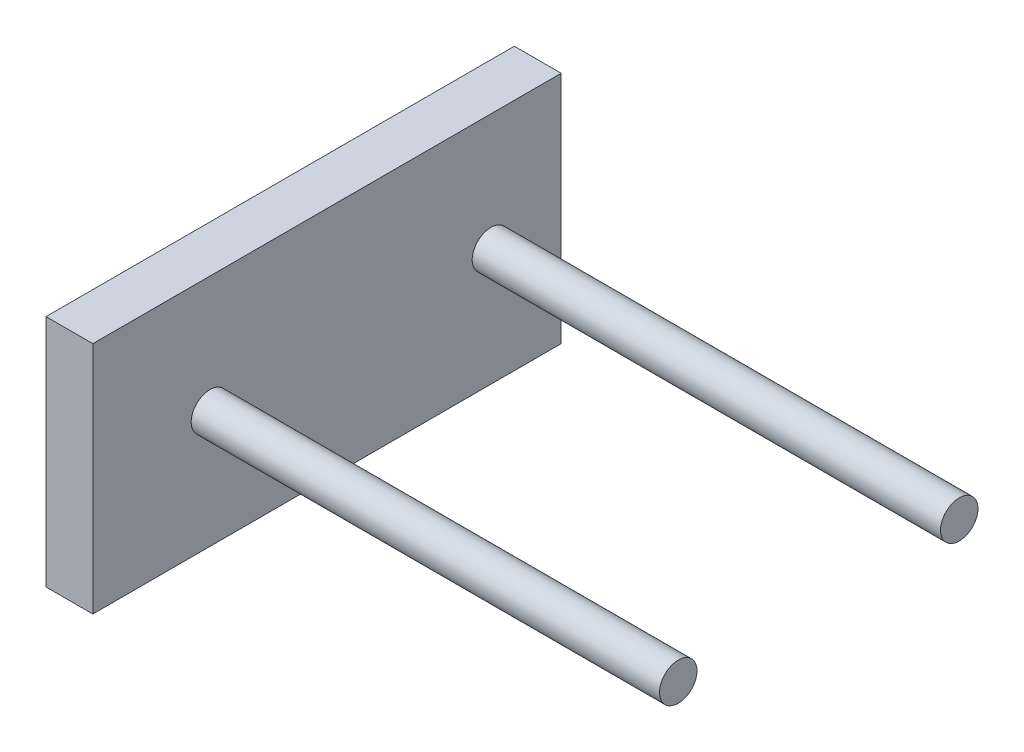
ISO-10303-21;
HEADER;
FILE_DESCRIPTION(('STEP AP214'),'2;1');
FILE_NAME('part.step','',(''),(''),'','','');
FILE_SCHEMA(('AUTOMOTIVE_DESIGN { 1 0 10303 214 1 1 1 1 }'));
ENDSEC;
DATA;
#1=APPLICATION_CONTEXT('core data for automotive mechanical design processes');
#2=APPLICATION_PROTOCOL_DEFINITION('international standard','automotive_design',2000,#1);
#3=PRODUCT_CONTEXT('',#1,'mechanical');
#4=PRODUCT('Part','Part','',(#3));
#5=PRODUCT_RELATED_PRODUCT_CATEGORY('part','',(#4));
#6=PRODUCT_DEFINITION_FORMATION('','',#4);
#7=PRODUCT_DEFINITION_CONTEXT('part definition',#1,'design');
#8=PRODUCT_DEFINITION('design','',#6,#7);
#9=PRODUCT_DEFINITION_SHAPE('','',#8);
#10=(LENGTH_UNIT() NAMED_UNIT(*) SI_UNIT(.MILLI.,.METRE.));
#11=(NAMED_UNIT(*) PLANE_ANGLE_UNIT() SI_UNIT($,.RADIAN.));
#12=(NAMED_UNIT(*) SI_UNIT($,.STERADIAN.) SOLID_ANGLE_UNIT());
#13=UNCERTAINTY_MEASURE_WITH_UNIT(LENGTH_MEASURE(1.E-05),#10,'distance_accuracy_value','');
#14=(GEOMETRIC_REPRESENTATION_CONTEXT(3) GLOBAL_UNCERTAINTY_ASSIGNED_CONTEXT((#13)) GLOBAL_UNIT_ASSIGNED_CONTEXT((#10,
#11,#12)) REPRESENTATION_CONTEXT('',''));
#15=CARTESIAN_POINT('',(0.,0.,0.));
#16=DIRECTION('',(0.,0.,1.));
#17=DIRECTION('',(1.,0.,0.));
#18=AXIS2_PLACEMENT_3D('',#15,#16,#17);
#19=CARTESIAN_POINT('',(0.,0.,0.));
#20=DIRECTION('',(1.,0.,0.));
#21=DIRECTION('',(0.,0.,-1.));
#22=AXIS2_PLACEMENT_3D('',#19,#20,#21);
#23=PLANE('',#22);
#24=DIRECTION('',(0.,1.,0.));
#25=VECTOR('',#24,1.);
#26=CARTESIAN_POINT('',(0.,-25.,-50.));
#27=LINE('',#26,#25);
#28=CARTESIAN_POINT('',(0.,-25.,-50.));
#29=VERTEX_POINT('',#28);
#30=CARTESIAN_POINT('',(0.,25.,-50.));
#31=VERTEX_POINT('',#30);
#32=EDGE_CURVE('E105',#29,#31,#27,.T.);
#33=ORIENTED_EDGE('',*,*,#32,.F.);
#34=DIRECTION('',(0.,0.,1.));
#35=VECTOR('',#34,1.);
#36=CARTESIAN_POINT('',(0.,-25.,-50.));
#37=LINE('',#36,#35);
#38=CARTESIAN_POINT('',(0.,-25.,50.));
#39=VERTEX_POINT('',#38);
#40=EDGE_CURVE('E111',#29,#39,#37,.T.);
#41=ORIENTED_EDGE('',*,*,#40,.T.);
#42=DIRECTION('',(0.,1.,0.));
#43=VECTOR('',#42,1.);
#44=CARTESIAN_POINT('',(0.,-25.,50.));
#45=LINE('',#44,#43);
#46=CARTESIAN_POINT('',(0.,25.,50.));
#47=VERTEX_POINT('',#46);
#48=EDGE_CURVE('E109',#39,#47,#45,.T.);
#49=ORIENTED_EDGE('',*,*,#48,.T.);
#50=DIRECTION('',(0.,0.,1.));
#51=VECTOR('',#50,1.);
#52=CARTESIAN_POINT('',(0.,25.,-50.));
#53=LINE('',#52,#51);
#54=EDGE_CURVE('E95',#31,#47,#53,.T.);
#55=ORIENTED_EDGE('',*,*,#54,.F.);
#56=EDGE_LOOP('',(#33,#41,#49,#55));
#57=FACE_BOUND('',#56,.T.);
#58=CARTESIAN_POINT('',(0.,5.00000000000001,-35.));
#59=DIRECTION('',(1.,0.,0.));
#60=DIRECTION('',(0.,0.,-1.));
#61=AXIS2_PLACEMENT_3D('',#58,#59,#60);
#62=CIRCLE('',#61,7.5);
#63=CARTESIAN_POINT('',(0.,5.00000000000001,-42.5));
#64=VERTEX_POINT('',#63);
#65=EDGE_CURVE('E11',#64,#64,#62,.F.);
#66=ORIENTED_EDGE('',*,*,#65,.F.);
#67=EDGE_LOOP('',(#66));
#68=FACE_BOUND('',#67,.T.);
#69=ADVANCED_FACE('F37',(#57,#68),#23,.F.);
#70=CARTESIAN_POINT('',(10.,-25.,-50.));
#71=DIRECTION('',(0.,0.,1.));
#72=DIRECTION('',(1.,0.,0.));
#73=AXIS2_PLACEMENT_3D('',#70,#71,#72);
#74=PLANE('',#73);
#75=ORIENTED_EDGE('',*,*,#32,.T.);
#76=DIRECTION('',(-1.,0.,0.));
#77=VECTOR('',#76,1.);
#78=CARTESIAN_POINT('',(10.,25.,-50.));
#79=LINE('',#78,#77);
#80=CARTESIAN_POINT('',(10.,25.,-50.));
#81=VERTEX_POINT('',#80);
#82=EDGE_CURVE('E47',#81,#31,#79,.T.);
#83=ORIENTED_EDGE('',*,*,#82,.F.);
#84=DIRECTION('',(0.,1.,0.));
#85=VECTOR('',#84,1.);
#86=CARTESIAN_POINT('',(10.,-25.,-50.));
#87=LINE('',#86,#85);
#88=CARTESIAN_POINT('',(10.,-25.,-50.));
#89=VERTEX_POINT('',#88);
#90=EDGE_CURVE('E89',#89,#81,#87,.T.);
#91=ORIENTED_EDGE('',*,*,#90,.F.);
#92=DIRECTION('',(-1.,0.,0.));
#93=VECTOR('',#92,1.);
#94=CARTESIAN_POINT('',(10.,-25.,-50.));
#95=LINE('',#94,#93);
#96=EDGE_CURVE('E55',#89,#29,#95,.T.);
#97=ORIENTED_EDGE('',*,*,#96,.T.);
#98=EDGE_LOOP('',(#75,#83,#91,#97));
#99=FACE_BOUND('',#98,.T.);
#100=ADVANCED_FACE('F39',(#99),#74,.F.);
#101=CARTESIAN_POINT('',(10.,25.,-50.));
#102=DIRECTION('',(0.,-1.,0.));
#103=DIRECTION('',(0.,0.,-1.));
#104=AXIS2_PLACEMENT_3D('',#101,#102,#103);
#105=PLANE('',#104);
#106=ORIENTED_EDGE('',*,*,#54,.T.);
#107=DIRECTION('',(-1.,0.,0.));
#108=VECTOR('',#107,1.);
#109=CARTESIAN_POINT('',(10.,25.,50.));
#110=LINE('',#109,#108);
#111=CARTESIAN_POINT('',(10.,25.,50.));
#112=VERTEX_POINT('',#111);
#113=EDGE_CURVE('E93',#112,#47,#110,.T.);
#114=ORIENTED_EDGE('',*,*,#113,.F.);
#115=DIRECTION('',(0.,0.,1.));
#116=VECTOR('',#115,1.);
#117=CARTESIAN_POINT('',(10.,25.,-50.));
#118=LINE('',#117,#116);
#119=EDGE_CURVE('E81',#81,#112,#118,.T.);
#120=ORIENTED_EDGE('',*,*,#119,.F.);
#121=ORIENTED_EDGE('',*,*,#82,.T.);
#122=EDGE_LOOP('',(#106,#114,#120,#121));
#123=FACE_BOUND('',#122,.T.);
#124=ADVANCED_FACE('F94',(#123),#105,.F.);
#125=CARTESIAN_POINT('',(10.,-25.,50.));
#126=DIRECTION('',(0.,0.,1.));
#127=DIRECTION('',(1.,0.,0.));
#128=AXIS2_PLACEMENT_3D('',#125,#126,#127);
#129=PLANE('',#128);
#130=ORIENTED_EDGE('',*,*,#48,.F.);
#131=DIRECTION('',(-1.,0.,0.));
#132=VECTOR('',#131,1.);
#133=CARTESIAN_POINT('',(10.,-25.,50.));
#134=LINE('',#133,#132);
#135=CARTESIAN_POINT('',(10.,-25.,50.));
#136=VERTEX_POINT('',#135);
#137=EDGE_CURVE('E69',#136,#39,#134,.T.);
#138=ORIENTED_EDGE('',*,*,#137,.F.);
#139=DIRECTION('',(0.,1.,0.));
#140=VECTOR('',#139,1.);
#141=CARTESIAN_POINT('',(10.,-25.,50.));
#142=LINE('',#141,#140);
#143=EDGE_CURVE('E88',#136,#112,#142,.T.);
#144=ORIENTED_EDGE('',*,*,#143,.T.);
#145=ORIENTED_EDGE('',*,*,#113,.T.);
#146=EDGE_LOOP('',(#130,#138,#144,#145));
#147=FACE_BOUND('',#146,.T.);
#148=ADVANCED_FACE('F99',(#147),#129,.T.);
#149=CARTESIAN_POINT('',(10.,-25.,-50.));
#150=DIRECTION('',(0.,-1.,0.));
#151=DIRECTION('',(0.,0.,-1.));
#152=AXIS2_PLACEMENT_3D('',#149,#150,#151);
#153=PLANE('',#152);
#154=ORIENTED_EDGE('',*,*,#40,.F.);
#155=ORIENTED_EDGE('',*,*,#96,.F.);
#156=DIRECTION('',(0.,0.,1.));
#157=VECTOR('',#156,1.);
#158=CARTESIAN_POINT('',(10.,-25.,-50.));
#159=LINE('',#158,#157);
#160=EDGE_CURVE('E100',#89,#136,#159,.T.);
#161=ORIENTED_EDGE('',*,*,#160,.T.);
#162=ORIENTED_EDGE('',*,*,#137,.T.);
#163=EDGE_LOOP('',(#154,#155,#161,#162));
#164=FACE_BOUND('',#163,.T.);
#165=ADVANCED_FACE('F117',(#164),#153,.T.);
#166=CARTESIAN_POINT('',(10.,0.,0.));
#167=DIRECTION('',(1.,0.,0.));
#168=DIRECTION('',(0.,0.,-1.));
#169=AXIS2_PLACEMENT_3D('',#166,#167,#168);
#170=PLANE('',#169);
#171=CARTESIAN_POINT('',(10.,0.,25.));
#172=DIRECTION('',(1.,0.,0.));
#173=DIRECTION('',(0.,0.,-1.));
#174=AXIS2_PLACEMENT_3D('',#171,#172,#173);
#175=CIRCLE('',#174,4.);
#176=CARTESIAN_POINT('',(10.,0.,21.));
#177=VERTEX_POINT('',#176);
#178=EDGE_CURVE('E164',#177,#177,#175,.T.);
#179=ORIENTED_EDGE('',*,*,#178,.F.);
#180=EDGE_LOOP('',(#179));
#181=FACE_BOUND('',#180,.T.);
#182=CARTESIAN_POINT('',(10.,0.,-35.));
#183=DIRECTION('',(1.,0.,0.));
#184=DIRECTION('',(0.,0.,-1.));
#185=AXIS2_PLACEMENT_3D('',#182,#183,#184);
#186=CIRCLE('',#185,4.);
#187=CARTESIAN_POINT('',(10.,0.,-39.));
#188=VERTEX_POINT('',#187);
#189=EDGE_CURVE('E163',#188,#188,#186,.T.);
#190=ORIENTED_EDGE('',*,*,#189,.F.);
#191=EDGE_LOOP('',(#190));
#192=FACE_BOUND('',#191,.T.);
#193=ORIENTED_EDGE('',*,*,#90,.T.);
#194=ORIENTED_EDGE('',*,*,#119,.T.);
#195=ORIENTED_EDGE('',*,*,#143,.F.);
#196=ORIENTED_EDGE('',*,*,#160,.F.);
#197=EDGE_LOOP('',(#193,#194,#195,#196));
#198=FACE_BOUND('',#197,.T.);
#199=ADVANCED_FACE('F85',(#181,#192,#198),#170,.T.);
#200=ORIENTED_EDGE('',*,*,#65,.T.);
#201=EDGE_LOOP('',(#200));
#202=FACE_BOUND('',#201,.T.);
#203=ADVANCED_FACE('F124',(#202),#23,.F.);
#204=CARTESIAN_POINT('',(110.,0.,-35.));
#205=DIRECTION('',(-1.,0.,0.));
#206=DIRECTION('',(0.,0.,1.));
#207=AXIS2_PLACEMENT_3D('',#204,#205,#206);
#208=CYLINDRICAL_SURFACE('',#207,4.);
#209=CARTESIAN_POINT('',(110.,0.,-35.));
#210=DIRECTION('',(1.,0.,0.));
#211=DIRECTION('',(0.,0.,-1.));
#212=AXIS2_PLACEMENT_3D('',#209,#210,#211);
#213=CIRCLE('',#212,4.);
#214=CARTESIAN_POINT('',(110.,0.,-39.));
#215=VERTEX_POINT('',#214);
#216=EDGE_CURVE('E107',#215,#215,#213,.T.);
#217=ORIENTED_EDGE('',*,*,#216,.F.);
#218=EDGE_LOOP('',(#217));
#219=FACE_BOUND('',#218,.T.);
#220=ORIENTED_EDGE('',*,*,#189,.T.);
#221=EDGE_LOOP('',(#220));
#222=FACE_BOUND('',#221,.T.);
#223=ADVANCED_FACE('F134',(#219,#222),#208,.T.);
#224=CARTESIAN_POINT('',(110.,0.,-35.));
#225=DIRECTION('',(1.,0.,0.));
#226=DIRECTION('',(0.,0.,-1.));
#227=AXIS2_PLACEMENT_3D('',#224,#225,#226);
#228=PLANE('',#227);
#229=ORIENTED_EDGE('',*,*,#216,.T.);
#230=EDGE_LOOP('',(#229));
#231=FACE_BOUND('',#230,.T.);
#232=ADVANCED_FACE('F139',(#231),#228,.T.);
#233=CARTESIAN_POINT('',(110.,0.,25.));
#234=DIRECTION('',(-1.,0.,0.));
#235=DIRECTION('',(0.,0.,1.));
#236=AXIS2_PLACEMENT_3D('',#233,#234,#235);
#237=CYLINDRICAL_SURFACE('',#236,4.);
#238=CARTESIAN_POINT('',(110.,0.,25.));
#239=DIRECTION('',(1.,0.,0.));
#240=DIRECTION('',(0.,0.,-1.));
#241=AXIS2_PLACEMENT_3D('',#238,#239,#240);
#242=CIRCLE('',#241,4.);
#243=CARTESIAN_POINT('',(110.,0.,21.));
#244=VERTEX_POINT('',#243);
#245=EDGE_CURVE('E162',#244,#244,#242,.T.);
#246=ORIENTED_EDGE('',*,*,#245,.F.);
#247=EDGE_LOOP('',(#246));
#248=FACE_BOUND('',#247,.T.);
#249=ORIENTED_EDGE('',*,*,#178,.T.);
#250=EDGE_LOOP('',(#249));
#251=FACE_BOUND('',#250,.T.);
#252=ADVANCED_FACE('F146',(#248,#251),#237,.T.);
#253=CARTESIAN_POINT('',(110.,0.,25.));
#254=DIRECTION('',(1.,0.,0.));
#255=DIRECTION('',(0.,0.,-1.));
#256=AXIS2_PLACEMENT_3D('',#253,#254,#255);
#257=PLANE('',#256);
#258=ORIENTED_EDGE('',*,*,#245,.T.);
#259=EDGE_LOOP('',(#258));
#260=FACE_BOUND('',#259,.T.);
#261=ADVANCED_FACE('F154',(#260),#257,.T.);
#262=CLOSED_SHELL('',(#69,#100,#124,#148,#165,#199,#203,#223,#232,#252,#261));
#263=MANIFOLD_SOLID_BREP('B2',#262);
#264=ADVANCED_BREP_SHAPE_REPRESENTATION('',(#18,#263),#14);
#265=SHAPE_DEFINITION_REPRESENTATION(#9,#264);
ENDSEC;
END-ISO-10303-21;
